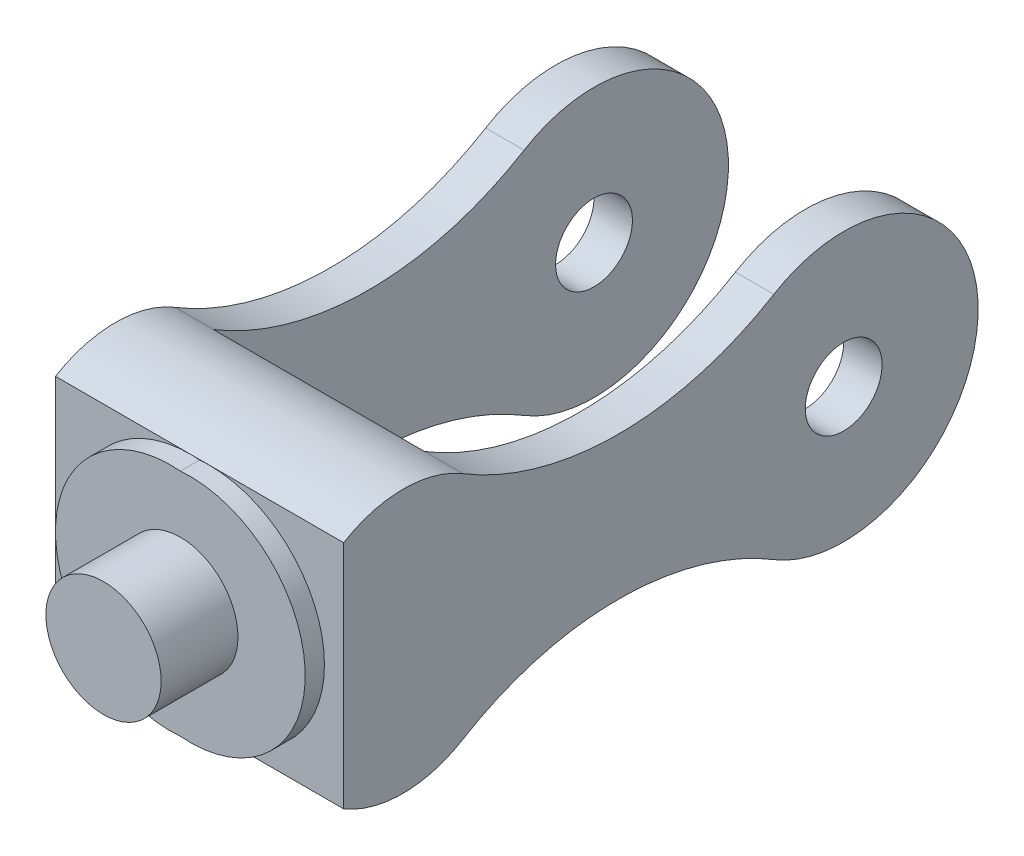
ISO-10303-21;
HEADER;
FILE_DESCRIPTION(('STEP AP214'),'2;1');
FILE_NAME('part.step','',(''),(''),'','','');
FILE_SCHEMA(('AUTOMOTIVE_DESIGN { 1 0 10303 214 1 1 1 1 }'));
ENDSEC;
DATA;
#1=APPLICATION_CONTEXT('core data for automotive mechanical design processes');
#2=APPLICATION_PROTOCOL_DEFINITION('international standard','automotive_design',2000,#1);
#3=PRODUCT_CONTEXT('',#1,'mechanical');
#4=PRODUCT('Part','Part','',(#3));
#5=PRODUCT_RELATED_PRODUCT_CATEGORY('part','',(#4));
#6=PRODUCT_DEFINITION_FORMATION('','',#4);
#7=PRODUCT_DEFINITION_CONTEXT('part definition',#1,'design');
#8=PRODUCT_DEFINITION('design','',#6,#7);
#9=PRODUCT_DEFINITION_SHAPE('','',#8);
#10=(LENGTH_UNIT() NAMED_UNIT(*) SI_UNIT(.MILLI.,.METRE.));
#11=(NAMED_UNIT(*) PLANE_ANGLE_UNIT() SI_UNIT($,.RADIAN.));
#12=(NAMED_UNIT(*) SI_UNIT($,.STERADIAN.) SOLID_ANGLE_UNIT());
#13=UNCERTAINTY_MEASURE_WITH_UNIT(LENGTH_MEASURE(1.E-05),#10,'distance_accuracy_value','');
#14=(GEOMETRIC_REPRESENTATION_CONTEXT(3) GLOBAL_UNCERTAINTY_ASSIGNED_CONTEXT((#13)) GLOBAL_UNIT_ASSIGNED_CONTEXT((#10,
#11,#12)) REPRESENTATION_CONTEXT('',''));
#15=CARTESIAN_POINT('',(0.,0.,0.));
#16=DIRECTION('',(0.,0.,1.));
#17=DIRECTION('',(1.,0.,0.));
#18=AXIS2_PLACEMENT_3D('',#15,#16,#17);
#19=CARTESIAN_POINT('',(0.,0.,5.));
#20=DIRECTION('',(0.,0.,-1.));
#21=DIRECTION('',(-1.,0.,0.));
#22=AXIS2_PLACEMENT_3D('',#19,#20,#21);
#23=CYLINDRICAL_SURFACE('',#22,30.);
#24=DIRECTION('',(0.,0.,-1.));
#25=VECTOR('',#24,1.);
#26=CARTESIAN_POINT('',(2.5,-29.8956518577535,2.5));
#27=LINE('',#26,#25);
#28=CARTESIAN_POINT('',(2.5,-29.8956518577535,5.));
#29=VERTEX_POINT('',#28);
#30=CARTESIAN_POINT('',(2.5,-29.8956518577535,0.));
#31=VERTEX_POINT('',#30);
#32=EDGE_CURVE('E62',#29,#31,#27,.T.);
#33=ORIENTED_EDGE('',*,*,#32,.F.);
#34=CARTESIAN_POINT('',(0.,0.,5.));
#35=DIRECTION('',(0.,0.,1.));
#36=DIRECTION('',(1.,0.,0.));
#37=AXIS2_PLACEMENT_3D('',#34,#35,#36);
#38=CIRCLE('',#37,30.);
#39=CARTESIAN_POINT('',(2.5,29.8956518577535,5.));
#40=VERTEX_POINT('',#39);
#41=EDGE_CURVE('E54',#40,#29,#38,.T.);
#42=ORIENTED_EDGE('',*,*,#41,.F.);
#43=DIRECTION('',(0.,0.,-1.));
#44=VECTOR('',#43,1.);
#45=CARTESIAN_POINT('',(2.5,29.8956518577535,2.5));
#46=LINE('',#45,#44);
#47=CARTESIAN_POINT('',(2.5,29.8956518577535,0.));
#48=VERTEX_POINT('',#47);
#49=EDGE_CURVE('E227',#48,#40,#46,.F.);
#50=ORIENTED_EDGE('',*,*,#49,.F.);
#51=CARTESIAN_POINT('',(0.,0.,0.));
#52=DIRECTION('',(0.,0.,1.));
#53=DIRECTION('',(1.,0.,0.));
#54=AXIS2_PLACEMENT_3D('',#51,#52,#53);
#55=CIRCLE('',#54,30.);
#56=CARTESIAN_POINT('',(0.,30.,0.));
#57=VERTEX_POINT('',#56);
#58=EDGE_CURVE('E299',#48,#57,#55,.T.);
#59=ORIENTED_EDGE('',*,*,#58,.T.);
#60=CARTESIAN_POINT('',(0.,-30.,0.));
#61=VERTEX_POINT('',#60);
#62=EDGE_CURVE('E153',#57,#61,#55,.T.);
#63=ORIENTED_EDGE('',*,*,#62,.T.);
#64=EDGE_CURVE('E48',#61,#31,#55,.T.);
#65=ORIENTED_EDGE('',*,*,#64,.T.);
#66=EDGE_LOOP('',(#33,#42,#50,#59,#63,#65));
#67=FACE_BOUND('',#66,.T.);
#68=ADVANCED_FACE('F45',(#67),#23,.T.);
#69=CARTESIAN_POINT('',(-25.,-30.,0.));
#70=DIRECTION('',(0.,0.,-1.));
#71=DIRECTION('',(0.,1.,0.));
#72=AXIS2_PLACEMENT_3D('',#69,#70,#71);
#73=PLANE('',#72);
#74=CARTESIAN_POINT('',(5.,0.,0.));
#75=DIRECTION('',(0.,0.,-1.));
#76=DIRECTION('',(-1.,0.,0.));
#77=AXIS2_PLACEMENT_3D('',#74,#75,#76);
#78=CIRCLE('',#77,30.);
#79=CARTESIAN_POINT('',(5.,30.,0.));
#80=VERTEX_POINT('',#79);
#81=EDGE_CURVE('E231',#48,#80,#78,.T.);
#82=ORIENTED_EDGE('',*,*,#81,.T.);
#83=DIRECTION('',(1.,0.,0.));
#84=VECTOR('',#83,1.);
#85=CARTESIAN_POINT('',(-25.,30.,0.));
#86=LINE('',#85,#84);
#87=EDGE_CURVE('E159',#57,#80,#86,.T.);
#88=ORIENTED_EDGE('',*,*,#87,.F.);
#89=ORIENTED_EDGE('',*,*,#58,.F.);
#90=EDGE_LOOP('',(#82,#88,#89));
#91=FACE_BOUND('',#90,.T.);
#92=ADVANCED_FACE('F345',(#91),#73,.F.);
#93=CARTESIAN_POINT('',(5.,-30.,0.));
#94=VERTEX_POINT('',#93);
#95=EDGE_CURVE('E228',#94,#31,#78,.T.);
#96=ORIENTED_EDGE('',*,*,#95,.T.);
#97=ORIENTED_EDGE('',*,*,#64,.F.);
#98=DIRECTION('',(1.,0.,0.));
#99=VECTOR('',#98,1.);
#100=CARTESIAN_POINT('',(-25.,-30.,0.));
#101=LINE('',#100,#99);
#102=EDGE_CURVE('E288',#61,#94,#101,.T.);
#103=ORIENTED_EDGE('',*,*,#102,.T.);
#104=EDGE_LOOP('',(#96,#97,#103));
#105=FACE_BOUND('',#104,.T.);
#106=ADVANCED_FACE('F307',(#105),#73,.F.);
#107=CARTESIAN_POINT('',(40.,30.,0.));
#108=VERTEX_POINT('',#107);
#109=EDGE_CURVE('E161',#80,#108,#86,.T.);
#110=ORIENTED_EDGE('',*,*,#109,.F.);
#111=EDGE_CURVE('E222',#80,#94,#78,.T.);
#112=ORIENTED_EDGE('',*,*,#111,.T.);
#113=CARTESIAN_POINT('',(40.,-30.,0.));
#114=VERTEX_POINT('',#113);
#115=EDGE_CURVE('E158',#94,#114,#101,.T.);
#116=ORIENTED_EDGE('',*,*,#115,.T.);
#117=DIRECTION('',(0.,-1.,0.));
#118=VECTOR('',#117,1.);
#119=CARTESIAN_POINT('',(40.,30.,0.));
#120=LINE('',#119,#118);
#121=EDGE_CURVE('E241',#108,#114,#120,.T.);
#122=ORIENTED_EDGE('',*,*,#121,.F.);
#123=EDGE_LOOP('',(#110,#112,#116,#122));
#124=FACE_BOUND('',#123,.T.);
#125=ADVANCED_FACE('F318',(#124),#73,.F.);
#126=CARTESIAN_POINT('',(0.,0.,5.));
#127=DIRECTION('',(0.,0.,1.));
#128=DIRECTION('',(1.,0.,0.));
#129=AXIS2_PLACEMENT_3D('',#126,#127,#128);
#130=PLANE('',#129);
#131=CARTESIAN_POINT('',(2.5,0.,5.));
#132=DIRECTION('',(0.,0.,1.));
#133=DIRECTION('',(1.,0.,0.));
#134=AXIS2_PLACEMENT_3D('',#131,#132,#133);
#135=CIRCLE('',#134,15.);
#136=CARTESIAN_POINT('',(17.5,0.,5.));
#137=VERTEX_POINT('',#136);
#138=EDGE_CURVE('E11',#137,#137,#135,.T.);
#139=ORIENTED_EDGE('',*,*,#138,.F.);
#140=EDGE_LOOP('',(#139));
#141=FACE_BOUND('',#140,.T.);
#142=ORIENTED_EDGE('',*,*,#41,.T.);
#143=CARTESIAN_POINT('',(5.,0.,5.));
#144=DIRECTION('',(0.,0.,-1.));
#145=DIRECTION('',(-1.,0.,0.));
#146=AXIS2_PLACEMENT_3D('',#143,#144,#145);
#147=CIRCLE('',#146,30.);
#148=EDGE_CURVE('E223',#40,#29,#147,.T.);
#149=ORIENTED_EDGE('',*,*,#148,.F.);
#150=EDGE_LOOP('',(#142,#149));
#151=FACE_BOUND('',#150,.T.);
#152=ADVANCED_FACE('F348',(#141,#151),#130,.T.);
#153=ORIENTED_EDGE('',*,*,#62,.F.);
#154=CARTESIAN_POINT('',(-35.,30.,0.));
#155=VERTEX_POINT('',#154);
#156=EDGE_CURVE('E147',#155,#57,#86,.T.);
#157=ORIENTED_EDGE('',*,*,#156,.F.);
#158=DIRECTION('',(0.,-1.,0.));
#159=VECTOR('',#158,1.);
#160=CARTESIAN_POINT('',(-35.,30.,0.));
#161=LINE('',#160,#159);
#162=CARTESIAN_POINT('',(-35.,-30.,0.));
#163=VERTEX_POINT('',#162);
#164=EDGE_CURVE('E152',#155,#163,#161,.T.);
#165=ORIENTED_EDGE('',*,*,#164,.T.);
#166=EDGE_CURVE('E284',#163,#61,#101,.T.);
#167=ORIENTED_EDGE('',*,*,#166,.T.);
#168=EDGE_LOOP('',(#153,#157,#165,#167));
#169=FACE_BOUND('',#168,.T.);
#170=ADVANCED_FACE('F149',(#169),#73,.F.);
#171=CARTESIAN_POINT('',(-25.,4.34567070726026,-15.55170050315));
#172=DIRECTION('',(1.,0.,0.));
#173=DIRECTION('',(0.,0.,-1.));
#174=AXIS2_PLACEMENT_3D('',#171,#172,#173);
#175=CYLINDRICAL_SURFACE('',#174,30.);
#176=DIRECTION('',(-1.,0.,0.));
#177=VECTOR('',#176,1.);
#178=CARTESIAN_POINT('',(40.,30.,-31.1034010063));
#179=LINE('',#178,#177);
#180=CARTESIAN_POINT('',(40.,30.,-31.1034010063));
#181=VERTEX_POINT('',#180);
#182=CARTESIAN_POINT('',(30.,30.,-31.1034010063));
#183=VERTEX_POINT('',#182);
#184=EDGE_CURVE('E258',#181,#183,#179,.T.);
#185=ORIENTED_EDGE('',*,*,#184,.T.);
#186=DIRECTION('',(1.,0.,0.));
#187=VECTOR('',#186,1.);
#188=CARTESIAN_POINT('',(-25.,30.,-31.1034010063));
#189=LINE('',#188,#187);
#190=CARTESIAN_POINT('',(-25.,30.,-31.1034010063));
#191=VERTEX_POINT('',#190);
#192=EDGE_CURVE('E292',#191,#183,#189,.T.);
#193=ORIENTED_EDGE('',*,*,#192,.F.);
#194=DIRECTION('',(1.,0.,0.));
#195=VECTOR('',#194,1.);
#196=CARTESIAN_POINT('',(-35.,30.,-31.1034010063));
#197=LINE('',#196,#195);
#198=CARTESIAN_POINT('',(-35.,30.,-31.1034010063));
#199=VERTEX_POINT('',#198);
#200=EDGE_CURVE('E169',#199,#191,#197,.T.);
#201=ORIENTED_EDGE('',*,*,#200,.F.);
#202=CARTESIAN_POINT('',(-35.,4.34567070726026,-15.55170050315));
#203=DIRECTION('',(1.,0.,0.));
#204=DIRECTION('',(0.,0.,1.));
#205=AXIS2_PLACEMENT_3D('',#202,#203,#204);
#206=CIRCLE('',#205,30.);
#207=EDGE_CURVE('E164',#199,#155,#206,.T.);
#208=ORIENTED_EDGE('',*,*,#207,.T.);
#209=ORIENTED_EDGE('',*,*,#156,.T.);
#210=ORIENTED_EDGE('',*,*,#87,.T.);
#211=ORIENTED_EDGE('',*,*,#109,.T.);
#212=CARTESIAN_POINT('',(40.,4.34567070726026,-15.55170050315));
#213=DIRECTION('',(1.,0.,0.));
#214=DIRECTION('',(0.,0.,1.));
#215=AXIS2_PLACEMENT_3D('',#212,#213,#214);
#216=CIRCLE('',#215,30.);
#217=EDGE_CURVE('E237',#181,#108,#216,.T.);
#218=ORIENTED_EDGE('',*,*,#217,.F.);
#219=EDGE_LOOP('',(#185,#193,#201,#208,#209,#210,#211,#218));
#220=FACE_BOUND('',#219,.T.);
#221=ADVANCED_FACE('F166',(#220),#175,.T.);
#222=CARTESIAN_POINT('',(-25.,30.,-31.1034010063));
#223=DIRECTION('',(0.,0.,1.));
#224=DIRECTION('',(0.,-1.,0.));
#225=AXIS2_PLACEMENT_3D('',#222,#223,#224);
#226=PLANE('',#225);
#227=DIRECTION('',(0.,-1.,0.));
#228=VECTOR('',#227,1.);
#229=CARTESIAN_POINT('',(30.,30.,-31.1034010063));
#230=LINE('',#229,#228);
#231=CARTESIAN_POINT('',(30.,-29.8066306699357,-31.1034010063));
#232=VERTEX_POINT('',#231);
#233=EDGE_CURVE('E280',#183,#232,#230,.T.);
#234=ORIENTED_EDGE('',*,*,#233,.T.);
#235=DIRECTION('',(1.,0.,0.));
#236=VECTOR('',#235,1.);
#237=CARTESIAN_POINT('',(-25.,-29.8066306699357,-31.1034010063));
#238=LINE('',#237,#236);
#239=CARTESIAN_POINT('',(-25.,-29.8066306699357,-31.1034010063));
#240=VERTEX_POINT('',#239);
#241=EDGE_CURVE('E287',#240,#232,#238,.T.);
#242=ORIENTED_EDGE('',*,*,#241,.F.);
#243=DIRECTION('',(0.,-1.,0.));
#244=VECTOR('',#243,1.);
#245=CARTESIAN_POINT('',(-25.,30.,-31.1034010063));
#246=LINE('',#245,#244);
#247=EDGE_CURVE('E218',#191,#240,#246,.T.);
#248=ORIENTED_EDGE('',*,*,#247,.F.);
#249=ORIENTED_EDGE('',*,*,#192,.T.);
#250=EDGE_LOOP('',(#234,#242,#248,#249));
#251=FACE_BOUND('',#250,.T.);
#252=ADVANCED_FACE('F374',(#251),#226,.F.);
#253=CARTESIAN_POINT('',(-25.,-4.24966399622853,-15.3922121767104));
#254=DIRECTION('',(1.,0.,0.));
#255=DIRECTION('',(0.,0.,-1.));
#256=AXIS2_PLACEMENT_3D('',#253,#254,#255);
#257=CYLINDRICAL_SURFACE('',#256,30.);
#258=CARTESIAN_POINT('',(40.,-4.24966399622853,-15.3922121767104));
#259=DIRECTION('',(1.,0.,0.));
#260=DIRECTION('',(0.,0.,-1.));
#261=AXIS2_PLACEMENT_3D('',#258,#259,#260);
#262=CIRCLE('',#261,30.);
#263=CARTESIAN_POINT('',(40.,-29.8066306699357,-31.1034010063));
#264=VERTEX_POINT('',#263);
#265=EDGE_CURVE('E246',#114,#264,#262,.T.);
#266=ORIENTED_EDGE('',*,*,#265,.F.);
#267=ORIENTED_EDGE('',*,*,#115,.F.);
#268=ORIENTED_EDGE('',*,*,#102,.F.);
#269=ORIENTED_EDGE('',*,*,#166,.F.);
#270=CARTESIAN_POINT('',(-35.,-4.24966399622853,-15.3922121767104));
#271=DIRECTION('',(1.,0.,0.));
#272=DIRECTION('',(0.,0.,-1.));
#273=AXIS2_PLACEMENT_3D('',#270,#271,#272);
#274=CIRCLE('',#273,30.);
#275=CARTESIAN_POINT('',(-35.,-29.8066306699357,-31.1034010063));
#276=VERTEX_POINT('',#275);
#277=EDGE_CURVE('E177',#163,#276,#274,.T.);
#278=ORIENTED_EDGE('',*,*,#277,.T.);
#279=DIRECTION('',(1.,0.,0.));
#280=VECTOR('',#279,1.);
#281=CARTESIAN_POINT('',(-35.,-29.8066306699357,-31.1034010063));
#282=LINE('',#281,#280);
#283=EDGE_CURVE('E214',#276,#240,#282,.T.);
#284=ORIENTED_EDGE('',*,*,#283,.T.);
#285=ORIENTED_EDGE('',*,*,#241,.T.);
#286=DIRECTION('',(-1.,0.,0.));
#287=VECTOR('',#286,1.);
#288=CARTESIAN_POINT('',(40.,-29.8066306699357,-31.1034010063));
#289=LINE('',#288,#287);
#290=EDGE_CURVE('E277',#264,#232,#289,.T.);
#291=ORIENTED_EDGE('',*,*,#290,.F.);
#292=EDGE_LOOP('',(#266,#267,#268,#269,#278,#284,#285,#291));
#293=FACE_BOUND('',#292,.T.);
#294=ADVANCED_FACE('F312',(#293),#257,.T.);
#295=CARTESIAN_POINT('',(30.,4.34567070726026,-15.55170050315));
#296=DIRECTION('',(-1.,0.,0.));
#297=DIRECTION('',(0.,0.,1.));
#298=AXIS2_PLACEMENT_3D('',#295,#296,#297);
#299=PLANE('',#298);
#300=CARTESIAN_POINT('',(30.,0.0966846650321436,-130.159924397795));
#301=DIRECTION('',(-1.,0.,0.));
#302=DIRECTION('',(0.,0.,1.));
#303=AXIS2_PLACEMENT_3D('',#300,#301,#302);
#304=CIRCLE('',#303,9.99999999999999);
#305=CARTESIAN_POINT('',(30.,0.0966846650321436,-120.159924397795));
#306=VERTEX_POINT('',#305);
#307=EDGE_CURVE('E613',#306,#306,#304,.T.);
#308=ORIENTED_EDGE('',*,*,#307,.F.);
#309=EDGE_LOOP('',(#308));
#310=FACE_BOUND('',#309,.T.);
#311=ORIENTED_EDGE('',*,*,#233,.F.);
#312=CARTESIAN_POINT('',(30.,96.7012561611233,-71.53782231449));
#313=DIRECTION('',(-1.,0.,0.));
#314=DIRECTION('',(0.,0.,-1.));
#315=AXIS2_PLACEMENT_3D('',#312,#313,#314);
#316=CIRCLE('',#315,78.);
#317=CARTESIAN_POINT('',(30.,30.,-111.97224362268));
#318=VERTEX_POINT('',#317);
#319=EDGE_CURVE('E242',#318,#183,#316,.T.);
#320=ORIENTED_EDGE('',*,*,#319,.F.);
#321=CARTESIAN_POINT('',(30.,0.0966846650321436,-130.159924397795));
#322=DIRECTION('',(1.,0.,0.));
#323=DIRECTION('',(0.,0.,-1.));
#324=AXIS2_PLACEMENT_3D('',#321,#322,#323);
#325=CIRCLE('',#324,35.);
#326=CARTESIAN_POINT('',(30.,-29.8066306699357,-111.97224362268));
#327=VERTEX_POINT('',#326);
#328=EDGE_CURVE('E261',#327,#318,#325,.T.);
#329=ORIENTED_EDGE('',*,*,#328,.F.);
#330=CARTESIAN_POINT('',(30.,-96.507886831059,-71.53782231449));
#331=DIRECTION('',(-1.,0.,0.));
#332=DIRECTION('',(0.,0.,1.));
#333=AXIS2_PLACEMENT_3D('',#330,#331,#332);
#334=CIRCLE('',#333,78.);
#335=EDGE_CURVE('E236',#232,#327,#334,.T.);
#336=ORIENTED_EDGE('',*,*,#335,.F.);
#337=EDGE_LOOP('',(#311,#320,#329,#336));
#338=FACE_BOUND('',#337,.T.);
#339=ADVANCED_FACE('F373',(#310,#338),#299,.T.);
#340=CARTESIAN_POINT('',(40.,-96.507886831059,-71.53782231449));
#341=DIRECTION('',(-1.,0.,0.));
#342=DIRECTION('',(0.,0.,1.));
#343=AXIS2_PLACEMENT_3D('',#340,#341,#342);
#344=CYLINDRICAL_SURFACE('',#343,78.);
#345=ORIENTED_EDGE('',*,*,#335,.T.);
#346=DIRECTION('',(-1.,0.,0.));
#347=VECTOR('',#346,1.);
#348=CARTESIAN_POINT('',(40.,-29.8066306699357,-111.97224362268));
#349=LINE('',#348,#347);
#350=CARTESIAN_POINT('',(40.,-29.8066306699357,-111.97224362268));
#351=VERTEX_POINT('',#350);
#352=EDGE_CURVE('E273',#351,#327,#349,.T.);
#353=ORIENTED_EDGE('',*,*,#352,.F.);
#354=CARTESIAN_POINT('',(40.,-96.507886831059,-71.53782231449));
#355=DIRECTION('',(-1.,0.,0.));
#356=DIRECTION('',(0.,0.,1.));
#357=AXIS2_PLACEMENT_3D('',#354,#355,#356);
#358=CIRCLE('',#357,78.);
#359=EDGE_CURVE('E249',#264,#351,#358,.T.);
#360=ORIENTED_EDGE('',*,*,#359,.F.);
#361=ORIENTED_EDGE('',*,*,#290,.T.);
#362=EDGE_LOOP('',(#345,#353,#360,#361));
#363=FACE_BOUND('',#362,.T.);
#364=ADVANCED_FACE('F327',(#363),#344,.F.);
#365=CARTESIAN_POINT('',(40.,0.0966846650321436,-130.159924397795));
#366=DIRECTION('',(-1.,0.,0.));
#367=DIRECTION('',(0.,0.,1.));
#368=AXIS2_PLACEMENT_3D('',#365,#366,#367);
#369=CYLINDRICAL_SURFACE('',#368,35.);
#370=ORIENTED_EDGE('',*,*,#328,.T.);
#371=DIRECTION('',(-1.,0.,0.));
#372=VECTOR('',#371,1.);
#373=CARTESIAN_POINT('',(40.,30.,-111.97224362268));
#374=LINE('',#373,#372);
#375=CARTESIAN_POINT('',(40.,30.,-111.97224362268));
#376=VERTEX_POINT('',#375);
#377=EDGE_CURVE('E269',#376,#318,#374,.T.);
#378=ORIENTED_EDGE('',*,*,#377,.F.);
#379=CARTESIAN_POINT('',(40.,0.0966846650321436,-130.159924397795));
#380=DIRECTION('',(1.,0.,0.));
#381=DIRECTION('',(0.,0.,-1.));
#382=AXIS2_PLACEMENT_3D('',#379,#380,#381);
#383=CIRCLE('',#382,35.);
#384=EDGE_CURVE('E252',#351,#376,#383,.T.);
#385=ORIENTED_EDGE('',*,*,#384,.F.);
#386=ORIENTED_EDGE('',*,*,#352,.T.);
#387=EDGE_LOOP('',(#370,#378,#385,#386));
#388=FACE_BOUND('',#387,.T.);
#389=ADVANCED_FACE('F333',(#388),#369,.T.);
#390=CARTESIAN_POINT('',(40.,96.7012561611233,-71.53782231449));
#391=DIRECTION('',(-1.,0.,0.));
#392=DIRECTION('',(0.,0.,1.));
#393=AXIS2_PLACEMENT_3D('',#390,#391,#392);
#394=CYLINDRICAL_SURFACE('',#393,78.);
#395=ORIENTED_EDGE('',*,*,#319,.T.);
#396=ORIENTED_EDGE('',*,*,#184,.F.);
#397=CARTESIAN_POINT('',(40.,96.7012561611233,-71.53782231449));
#398=DIRECTION('',(-1.,0.,0.));
#399=DIRECTION('',(0.,0.,-1.));
#400=AXIS2_PLACEMENT_3D('',#397,#398,#399);
#401=CIRCLE('',#400,78.);
#402=EDGE_CURVE('E255',#376,#181,#401,.T.);
#403=ORIENTED_EDGE('',*,*,#402,.F.);
#404=ORIENTED_EDGE('',*,*,#377,.T.);
#405=EDGE_LOOP('',(#395,#396,#403,#404));
#406=FACE_BOUND('',#405,.T.);
#407=ADVANCED_FACE('F337',(#406),#394,.F.);
#408=CARTESIAN_POINT('',(40.,4.34567070726026,-15.55170050315));
#409=DIRECTION('',(-1.,0.,0.));
#410=DIRECTION('',(0.,0.,1.));
#411=AXIS2_PLACEMENT_3D('',#408,#409,#410);
#412=PLANE('',#411);
#413=CARTESIAN_POINT('',(40.,0.0966846650321436,-130.159924397795));
#414=DIRECTION('',(-1.,0.,0.));
#415=DIRECTION('',(0.,0.,1.));
#416=AXIS2_PLACEMENT_3D('',#413,#414,#415);
#417=CIRCLE('',#416,9.99999999999999);
#418=CARTESIAN_POINT('',(40.,0.0966846650321436,-120.159924397795));
#419=VERTEX_POINT('',#418);
#420=EDGE_CURVE('E622',#419,#419,#417,.T.);
#421=ORIENTED_EDGE('',*,*,#420,.T.);
#422=EDGE_LOOP('',(#421));
#423=FACE_BOUND('',#422,.T.);
#424=ORIENTED_EDGE('',*,*,#217,.T.);
#425=ORIENTED_EDGE('',*,*,#121,.T.);
#426=ORIENTED_EDGE('',*,*,#265,.T.);
#427=ORIENTED_EDGE('',*,*,#359,.T.);
#428=ORIENTED_EDGE('',*,*,#384,.T.);
#429=ORIENTED_EDGE('',*,*,#402,.T.);
#430=EDGE_LOOP('',(#424,#425,#426,#427,#428,#429));
#431=FACE_BOUND('',#430,.T.);
#432=ADVANCED_FACE('F320',(#423,#431),#412,.F.);
#433=CARTESIAN_POINT('',(-35.,96.7012561611233,-71.53782231449));
#434=DIRECTION('',(1.,0.,0.));
#435=DIRECTION('',(0.,0.,1.));
#436=AXIS2_PLACEMENT_3D('',#433,#434,#435);
#437=CYLINDRICAL_SURFACE('',#436,78.);
#438=CARTESIAN_POINT('',(-25.,96.7012561611233,-71.53782231449));
#439=DIRECTION('',(-1.,0.,0.));
#440=DIRECTION('',(0.,0.,-1.));
#441=AXIS2_PLACEMENT_3D('',#438,#439,#440);
#442=CIRCLE('',#441,78.);
#443=CARTESIAN_POINT('',(-25.,30.,-111.97224362268));
#444=VERTEX_POINT('',#443);
#445=EDGE_CURVE('E172',#444,#191,#442,.T.);
#446=ORIENTED_EDGE('',*,*,#445,.F.);
#447=DIRECTION('',(1.,0.,0.));
#448=VECTOR('',#447,1.);
#449=CARTESIAN_POINT('',(-35.,30.,-111.97224362268));
#450=LINE('',#449,#448);
#451=CARTESIAN_POINT('',(-35.,30.,-111.97224362268));
#452=VERTEX_POINT('',#451);
#453=EDGE_CURVE('E208',#452,#444,#450,.T.);
#454=ORIENTED_EDGE('',*,*,#453,.F.);
#455=CARTESIAN_POINT('',(-35.,96.7012561611233,-71.53782231449));
#456=DIRECTION('',(-1.,0.,0.));
#457=DIRECTION('',(0.,0.,-1.));
#458=AXIS2_PLACEMENT_3D('',#455,#456,#457);
#459=CIRCLE('',#458,78.);
#460=EDGE_CURVE('E191',#452,#199,#459,.T.);
#461=ORIENTED_EDGE('',*,*,#460,.T.);
#462=ORIENTED_EDGE('',*,*,#200,.T.);
#463=EDGE_LOOP('',(#446,#454,#461,#462));
#464=FACE_BOUND('',#463,.T.);
#465=ADVANCED_FACE('F398',(#464),#437,.F.);
#466=CARTESIAN_POINT('',(-35.,0.0966846650321436,-130.159924397795));
#467=DIRECTION('',(1.,0.,0.));
#468=DIRECTION('',(0.,0.,1.));
#469=AXIS2_PLACEMENT_3D('',#466,#467,#468);
#470=CYLINDRICAL_SURFACE('',#469,35.);
#471=CARTESIAN_POINT('',(-25.,0.0966846650321436,-130.159924397795));
#472=DIRECTION('',(1.,0.,0.));
#473=DIRECTION('',(0.,0.,-1.));
#474=AXIS2_PLACEMENT_3D('',#471,#472,#473);
#475=CIRCLE('',#474,35.);
#476=CARTESIAN_POINT('',(-25.,-29.8066306699357,-111.97224362268));
#477=VERTEX_POINT('',#476);
#478=EDGE_CURVE('E198',#477,#444,#475,.T.);
#479=ORIENTED_EDGE('',*,*,#478,.F.);
#480=DIRECTION('',(1.,0.,0.));
#481=VECTOR('',#480,1.);
#482=CARTESIAN_POINT('',(-35.,-29.8066306699357,-111.97224362268));
#483=LINE('',#482,#481);
#484=CARTESIAN_POINT('',(-35.,-29.8066306699357,-111.97224362268));
#485=VERTEX_POINT('',#484);
#486=EDGE_CURVE('E211',#485,#477,#483,.T.);
#487=ORIENTED_EDGE('',*,*,#486,.F.);
#488=CARTESIAN_POINT('',(-35.,0.0966846650321436,-130.159924397795));
#489=DIRECTION('',(1.,0.,0.));
#490=DIRECTION('',(0.,0.,-1.));
#491=AXIS2_PLACEMENT_3D('',#488,#489,#490);
#492=CIRCLE('',#491,35.);
#493=EDGE_CURVE('E187',#485,#452,#492,.T.);
#494=ORIENTED_EDGE('',*,*,#493,.T.);
#495=ORIENTED_EDGE('',*,*,#453,.T.);
#496=EDGE_LOOP('',(#479,#487,#494,#495));
#497=FACE_BOUND('',#496,.T.);
#498=ADVANCED_FACE('F401',(#497),#470,.T.);
#499=CARTESIAN_POINT('',(-25.,4.34567070726026,-15.55170050315));
#500=DIRECTION('',(1.,0.,0.));
#501=DIRECTION('',(0.,0.,1.));
#502=AXIS2_PLACEMENT_3D('',#499,#500,#501);
#503=PLANE('',#502);
#504=CARTESIAN_POINT('',(-25.,0.0966846650321436,-130.159924397795));
#505=DIRECTION('',(-1.,0.,0.));
#506=DIRECTION('',(0.,0.,1.));
#507=AXIS2_PLACEMENT_3D('',#504,#505,#506);
#508=CIRCLE('',#507,9.99999999999999);
#509=CARTESIAN_POINT('',(-25.,0.0966846650321436,-120.159924397795));
#510=VERTEX_POINT('',#509);
#511=EDGE_CURVE('E630',#510,#510,#508,.T.);
#512=ORIENTED_EDGE('',*,*,#511,.T.);
#513=EDGE_LOOP('',(#512));
#514=FACE_BOUND('',#513,.T.);
#515=ORIENTED_EDGE('',*,*,#247,.T.);
#516=CARTESIAN_POINT('',(-25.,-96.507886831059,-71.53782231449));
#517=DIRECTION('',(-1.,0.,0.));
#518=DIRECTION('',(0.,0.,1.));
#519=AXIS2_PLACEMENT_3D('',#516,#517,#518);
#520=CIRCLE('',#519,78.);
#521=EDGE_CURVE('E194',#240,#477,#520,.T.);
#522=ORIENTED_EDGE('',*,*,#521,.T.);
#523=ORIENTED_EDGE('',*,*,#478,.T.);
#524=ORIENTED_EDGE('',*,*,#445,.T.);
#525=EDGE_LOOP('',(#515,#522,#523,#524));
#526=FACE_BOUND('',#525,.T.);
#527=ADVANCED_FACE('F410',(#514,#526),#503,.T.);
#528=CARTESIAN_POINT('',(-35.,-96.507886831059,-71.53782231449));
#529=DIRECTION('',(1.,0.,0.));
#530=DIRECTION('',(0.,0.,1.));
#531=AXIS2_PLACEMENT_3D('',#528,#529,#530);
#532=CYLINDRICAL_SURFACE('',#531,78.);
#533=ORIENTED_EDGE('',*,*,#521,.F.);
#534=ORIENTED_EDGE('',*,*,#283,.F.);
#535=CARTESIAN_POINT('',(-35.,-96.507886831059,-71.53782231449));
#536=DIRECTION('',(-1.,0.,0.));
#537=DIRECTION('',(0.,0.,1.));
#538=AXIS2_PLACEMENT_3D('',#535,#536,#537);
#539=CIRCLE('',#538,78.);
#540=EDGE_CURVE('E181',#276,#485,#539,.T.);
#541=ORIENTED_EDGE('',*,*,#540,.T.);
#542=ORIENTED_EDGE('',*,*,#486,.T.);
#543=EDGE_LOOP('',(#533,#534,#541,#542));
#544=FACE_BOUND('',#543,.T.);
#545=ADVANCED_FACE('F417',(#544),#532,.F.);
#546=CARTESIAN_POINT('',(-35.,4.34567070726026,-15.55170050315));
#547=DIRECTION('',(1.,0.,0.));
#548=DIRECTION('',(0.,0.,1.));
#549=AXIS2_PLACEMENT_3D('',#546,#547,#548);
#550=PLANE('',#549);
#551=CARTESIAN_POINT('',(-35.,0.0966846650321436,-130.159924397795));
#552=DIRECTION('',(-1.,0.,0.));
#553=DIRECTION('',(0.,0.,1.));
#554=AXIS2_PLACEMENT_3D('',#551,#552,#553);
#555=CIRCLE('',#554,9.99999999999999);
#556=CARTESIAN_POINT('',(-35.,0.0966846650321436,-120.159924397795));
#557=VERTEX_POINT('',#556);
#558=EDGE_CURVE('E623',#557,#557,#555,.T.);
#559=ORIENTED_EDGE('',*,*,#558,.F.);
#560=EDGE_LOOP('',(#559));
#561=FACE_BOUND('',#560,.T.);
#562=ORIENTED_EDGE('',*,*,#207,.F.);
#563=ORIENTED_EDGE('',*,*,#460,.F.);
#564=ORIENTED_EDGE('',*,*,#493,.F.);
#565=ORIENTED_EDGE('',*,*,#540,.F.);
#566=ORIENTED_EDGE('',*,*,#277,.F.);
#567=ORIENTED_EDGE('',*,*,#164,.F.);
#568=EDGE_LOOP('',(#562,#563,#564,#565,#566,#567));
#569=FACE_BOUND('',#568,.T.);
#570=ADVANCED_FACE('F175',(#561,#569),#550,.F.);
#571=CARTESIAN_POINT('',(5.,0.,5.));
#572=DIRECTION('',(0.,0.,-1.));
#573=DIRECTION('',(1.,0.,0.));
#574=AXIS2_PLACEMENT_3D('',#571,#572,#573);
#575=CYLINDRICAL_SURFACE('',#574,30.);
#576=ORIENTED_EDGE('',*,*,#148,.T.);
#577=ORIENTED_EDGE('',*,*,#32,.T.);
#578=ORIENTED_EDGE('',*,*,#95,.F.);
#579=ORIENTED_EDGE('',*,*,#111,.F.);
#580=ORIENTED_EDGE('',*,*,#81,.F.);
#581=ORIENTED_EDGE('',*,*,#49,.T.);
#582=EDGE_LOOP('',(#576,#577,#578,#579,#580,#581));
#583=FACE_BOUND('',#582,.T.);
#584=ADVANCED_FACE('F347',(#583),#575,.T.);
#585=CARTESIAN_POINT('',(2.5,0.,25.));
#586=DIRECTION('',(0.,0.,-1.));
#587=DIRECTION('',(-1.,0.,0.));
#588=AXIS2_PLACEMENT_3D('',#585,#586,#587);
#589=CYLINDRICAL_SURFACE('',#588,15.);
#590=CARTESIAN_POINT('',(2.5,0.,25.));
#591=DIRECTION('',(0.,0.,1.));
#592=DIRECTION('',(1.,0.,0.));
#593=AXIS2_PLACEMENT_3D('',#590,#591,#592);
#594=CIRCLE('',#593,15.);
#595=CARTESIAN_POINT('',(17.5,0.,25.));
#596=VERTEX_POINT('',#595);
#597=EDGE_CURVE('E199',#596,#596,#594,.T.);
#598=ORIENTED_EDGE('',*,*,#597,.F.);
#599=EDGE_LOOP('',(#598));
#600=FACE_BOUND('',#599,.T.);
#601=ORIENTED_EDGE('',*,*,#138,.T.);
#602=EDGE_LOOP('',(#601));
#603=FACE_BOUND('',#602,.T.);
#604=ADVANCED_FACE('F429',(#600,#603),#589,.T.);
#605=CARTESIAN_POINT('',(2.5,0.,25.));
#606=DIRECTION('',(0.,0.,1.));
#607=DIRECTION('',(1.,0.,0.));
#608=AXIS2_PLACEMENT_3D('',#605,#606,#607);
#609=PLANE('',#608);
#610=ORIENTED_EDGE('',*,*,#597,.T.);
#611=EDGE_LOOP('',(#610));
#612=FACE_BOUND('',#611,.T.);
#613=ADVANCED_FACE('F446',(#612),#609,.T.);
#614=CARTESIAN_POINT('',(40.,0.0966846650321436,-130.159924397795));
#615=DIRECTION('',(-1.,0.,0.));
#616=DIRECTION('',(0.,0.,1.));
#617=AXIS2_PLACEMENT_3D('',#614,#615,#616);
#618=CYLINDRICAL_SURFACE('',#617,9.99999999999999);
#619=ORIENTED_EDGE('',*,*,#420,.F.);
#620=EDGE_LOOP('',(#619));
#621=FACE_BOUND('',#620,.T.);
#622=ORIENTED_EDGE('',*,*,#307,.T.);
#623=EDGE_LOOP('',(#622));
#624=FACE_BOUND('',#623,.T.);
#625=ADVANCED_FACE('F457',(#621,#624),#618,.F.);
#626=CARTESIAN_POINT('',(-35.,0.0966846650321436,-130.159924397795));
#627=DIRECTION('',(1.,0.,0.));
#628=DIRECTION('',(0.,0.,-1.));
#629=AXIS2_PLACEMENT_3D('',#626,#627,#628);
#630=CYLINDRICAL_SURFACE('',#629,9.99999999999999);
#631=ORIENTED_EDGE('',*,*,#558,.T.);
#632=EDGE_LOOP('',(#631));
#633=FACE_BOUND('',#632,.T.);
#634=ORIENTED_EDGE('',*,*,#511,.F.);
#635=EDGE_LOOP('',(#634));
#636=FACE_BOUND('',#635,.T.);
#637=ADVANCED_FACE('F468',(#633,#636),#630,.F.);
#638=CLOSED_SHELL('',(#68,#92,#106,#125,#152,#170,#221,#252,#294,#339,#364,#389,#407,#432,#465,
#498,#527,#545,#570,#584,#604,#613,#625,#637));
#639=MANIFOLD_SOLID_BREP('B2',#638);
#640=ADVANCED_BREP_SHAPE_REPRESENTATION('',(#18,#639),#14);
#641=SHAPE_DEFINITION_REPRESENTATION(#9,#640);
ENDSEC;
END-ISO-10303-21;
